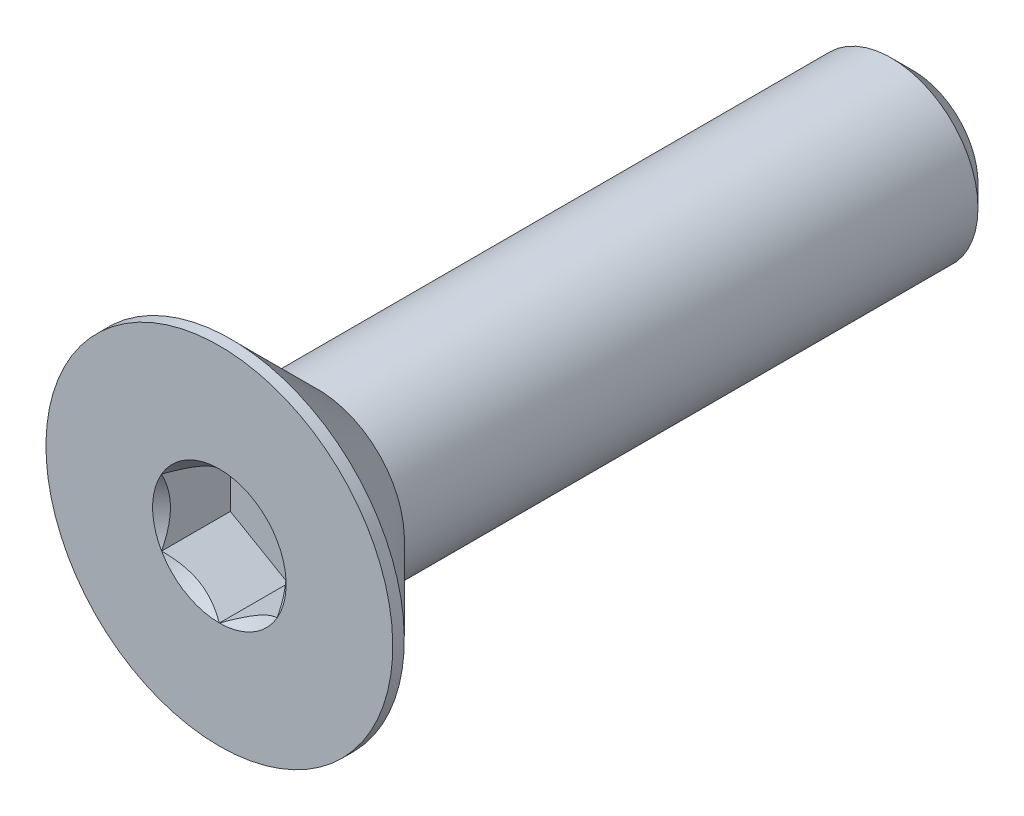
ISO-10303-21;
HEADER;
FILE_DESCRIPTION(('STEP AP214'),'2;1');
FILE_NAME('part.step','',(''),(''),'','','');
FILE_SCHEMA(('AUTOMOTIVE_DESIGN { 1 0 10303 214 1 1 1 1 }'));
ENDSEC;
DATA;
#1=APPLICATION_CONTEXT('core data for automotive mechanical design processes');
#2=APPLICATION_PROTOCOL_DEFINITION('international standard','automotive_design',2000,#1);
#3=PRODUCT_CONTEXT('',#1,'mechanical');
#4=PRODUCT('Part','Part','',(#3));
#5=PRODUCT_RELATED_PRODUCT_CATEGORY('part','',(#4));
#6=PRODUCT_DEFINITION_FORMATION('','',#4);
#7=PRODUCT_DEFINITION_CONTEXT('part definition',#1,'design');
#8=PRODUCT_DEFINITION('design','',#6,#7);
#9=PRODUCT_DEFINITION_SHAPE('','',#8);
#10=(LENGTH_UNIT() NAMED_UNIT(*) SI_UNIT(.MILLI.,.METRE.));
#11=(NAMED_UNIT(*) PLANE_ANGLE_UNIT() SI_UNIT($,.RADIAN.));
#12=(NAMED_UNIT(*) SI_UNIT($,.STERADIAN.) SOLID_ANGLE_UNIT());
#13=UNCERTAINTY_MEASURE_WITH_UNIT(LENGTH_MEASURE(1.E-05),#10,'distance_accuracy_value','');
#14=(GEOMETRIC_REPRESENTATION_CONTEXT(3) GLOBAL_UNCERTAINTY_ASSIGNED_CONTEXT((#13)) GLOBAL_UNIT_ASSIGNED_CONTEXT((#10,
#11,#12)) REPRESENTATION_CONTEXT('',''));
#15=CARTESIAN_POINT('',(0.,0.,0.));
#16=DIRECTION('',(0.,0.,1.));
#17=DIRECTION('',(1.,0.,0.));
#18=AXIS2_PLACEMENT_3D('',#15,#16,#17);
#19=CARTESIAN_POINT('',(1.,-0.577350269189626,-1.19));
#20=DIRECTION('',(0.,0.,1.));
#21=DIRECTION('',(1.,0.,0.));
#22=AXIS2_PLACEMENT_3D('',#19,#20,#21);
#23=PLANE('',#22);
#24=DIRECTION('',(0.,1.,0.));
#25=VECTOR('',#24,1.);
#26=CARTESIAN_POINT('',(-1.,0.577350269189626,-1.19));
#27=LINE('',#26,#25);
#28=CARTESIAN_POINT('',(-0.999999999999999,0.577350269189625,-1.19));
#29=VERTEX_POINT('',#28);
#30=CARTESIAN_POINT('',(-1.,-0.577350269189626,-1.19));
#31=VERTEX_POINT('',#30);
#32=EDGE_CURVE('E83',#29,#31,#27,.F.);
#33=ORIENTED_EDGE('',*,*,#32,.T.);
#34=DIRECTION('',(0.866025403784439,-0.5,0.));
#35=VECTOR('',#34,1.);
#36=CARTESIAN_POINT('',(-1.,-0.577350269189626,-1.19));
#37=LINE('',#36,#35);
#38=CARTESIAN_POINT('',(0.,-1.15470053837925,-1.19));
#39=VERTEX_POINT('',#38);
#40=EDGE_CURVE('E85',#31,#39,#37,.T.);
#41=ORIENTED_EDGE('',*,*,#40,.T.);
#42=DIRECTION('',(0.866025403784439,0.5,0.));
#43=VECTOR('',#42,1.);
#44=CARTESIAN_POINT('',(0.,-1.15470053837925,-1.19));
#45=LINE('',#44,#43);
#46=CARTESIAN_POINT('',(1.,-0.577350269189626,-1.19));
#47=VERTEX_POINT('',#46);
#48=EDGE_CURVE('E86',#39,#47,#45,.T.);
#49=ORIENTED_EDGE('',*,*,#48,.T.);
#50=DIRECTION('',(0.,1.,0.));
#51=VECTOR('',#50,1.);
#52=CARTESIAN_POINT('',(1.,-0.577350269189626,-1.19));
#53=LINE('',#52,#51);
#54=CARTESIAN_POINT('',(1.,0.577350269189626,-1.19));
#55=VERTEX_POINT('',#54);
#56=EDGE_CURVE('E72',#47,#55,#53,.T.);
#57=ORIENTED_EDGE('',*,*,#56,.T.);
#58=DIRECTION('',(-0.866025403784439,0.5,0.));
#59=VECTOR('',#58,1.);
#60=CARTESIAN_POINT('',(1.,0.577350269189626,-1.19));
#61=LINE('',#60,#59);
#62=CARTESIAN_POINT('',(0.,1.15470053837925,-1.19));
#63=VERTEX_POINT('',#62);
#64=EDGE_CURVE('E111',#55,#63,#61,.T.);
#65=ORIENTED_EDGE('',*,*,#64,.T.);
#66=DIRECTION('',(-0.866025403784439,-0.5,0.));
#67=VECTOR('',#66,1.);
#68=CARTESIAN_POINT('',(0.,1.15470053837925,-1.19));
#69=LINE('',#68,#67);
#70=EDGE_CURVE('E116',#63,#29,#69,.T.);
#71=ORIENTED_EDGE('',*,*,#70,.T.);
#72=EDGE_LOOP('',(#33,#41,#49,#57,#65,#71));
#73=FACE_BOUND('',#72,.T.);
#74=ADVANCED_FACE('F17',(#73),#23,.T.);
#75=CARTESIAN_POINT('',(0.,-1.15470053837925,-1.19));
#76=DIRECTION('',(0.5,-0.866025403784439,0.));
#77=DIRECTION('',(0.866025403784439,0.5,0.));
#78=AXIS2_PLACEMENT_3D('',#75,#76,#77);
#79=PLANE('',#78);
#80=CARTESIAN_POINT('',(-3.93149054121521E-11,-1.15470053837926,-9.98108843585172E-11));
#81=CARTESIAN_POINT('',(0.0343705355201057,-1.13485670043636,-0.0198247004221409));
#82=CARTESIAN_POINT('',(0.0693156756519455,-1.11468111438035,-0.0384849664872145));
#83=CARTESIAN_POINT('',(0.140572403035621,-1.07354102364821,-0.0726511232407905));
#84=CARTESIAN_POINT('',(0.176890763106012,-1.05257260868342,-0.0881380101422933));
#85=CARTESIAN_POINT('',(0.250125097696328,-1.01029074589262,-0.11466695978462));
#86=CARTESIAN_POINT('',(0.287022429458597,-0.988988061467716,-0.125775687570534));
#87=CARTESIAN_POINT('',(0.361628600499482,-0.945914168534358,-0.142891513233382));
#88=CARTESIAN_POINT('',(0.399335163701569,-0.924144274119301,-0.148911380305544));
#89=CARTESIAN_POINT('',(0.464327716043936,-0.886620806529054,-0.154341115390247));
#90=CARTESIAN_POINT('',(0.491529304810035,-0.87091596193258,-0.155143433217331));
#91=CARTESIAN_POINT('',(0.545879708710831,-0.839536741609904,-0.153791220399352));
#92=CARTESIAN_POINT('',(0.573028510861523,-0.823862373380022,-0.151636036594819));
#93=CARTESIAN_POINT('',(0.654087027893978,-0.777063216751215,-0.140876680449877));
#94=CARTESIAN_POINT('',(0.707593237347495,-0.746171392319914,-0.127977491939688));
#95=CARTESIAN_POINT('',(0.801462739355952,-0.691975810066637,-0.0968623195341796));
#96=CARTESIAN_POINT('',(0.842267871071583,-0.668416956286299,-0.0802830124023648));
#97=CARTESIAN_POINT('',(0.922281198810023,-0.622221239977752,-0.0429387151524039));
#98=CARTESIAN_POINT('',(0.961494106307927,-0.599581657278129,-0.0221873504710733));
#99=CARTESIAN_POINT('',(1.00000000003183,-0.577350269171246,-1.09229319045489E-10));
#100=B_SPLINE_CURVE_WITH_KNOTS('',3,(#80,#81,#82,#83,#84,#85,#86,#87,#88,#89,#90,#91,#92,#93,
#94,#95,#96,#97,#98,#99),.UNSPECIFIED.,.F.,.F.,(4,2,2,2,2,2,2,2,2,4),(0.,0.133182946587487,
0.267141541479663,0.398973326833972,0.530473323727982,0.624596460473079,0.718740387507005,
0.907081600610891,1.05673041335255,1.20589820631879),.UNSPECIFIED.);
#101=CARTESIAN_POINT('',(0.,-1.15470053839843,-1.08428125919993E-10));
#102=VERTEX_POINT('',#101);
#103=CARTESIAN_POINT('',(1.00000000001661,-0.577350269199215,-1.08427886418802E-10));
#104=VERTEX_POINT('',#103);
#105=EDGE_CURVE('E20',#102,#104,#100,.T.);
#106=ORIENTED_EDGE('',*,*,#105,.T.);
#107=DIRECTION('',(0.,0.,-1.));
#108=VECTOR('',#107,1.);
#109=CARTESIAN_POINT('',(1.,-0.577350269189626,-1.19));
#110=LINE('',#109,#108);
#111=EDGE_CURVE('E91',#104,#47,#110,.T.);
#112=ORIENTED_EDGE('',*,*,#111,.T.);
#113=ORIENTED_EDGE('',*,*,#48,.F.);
#114=DIRECTION('',(0.,0.,1.));
#115=VECTOR('',#114,1.);
#116=CARTESIAN_POINT('',(0.,-1.15470053837925,-1.19));
#117=LINE('',#116,#115);
#118=EDGE_CURVE('E59',#39,#102,#117,.T.);
#119=ORIENTED_EDGE('',*,*,#118,.T.);
#120=EDGE_LOOP('',(#106,#112,#113,#119));
#121=FACE_BOUND('',#120,.T.);
#122=ADVANCED_FACE('F90',(#121),#79,.F.);
#123=CARTESIAN_POINT('',(-1.,-0.577350269189626,-1.19));
#124=DIRECTION('',(-0.5,-0.866025403784439,0.));
#125=DIRECTION('',(0.866025403784439,-0.5,0.));
#126=AXIS2_PLACEMENT_3D('',#123,#124,#125);
#127=PLANE('',#126);
#128=CARTESIAN_POINT('',(-1.00000000001966,-0.577350269155583,-9.98096310247959E-11));
#129=CARTESIAN_POINT('',(-0.965629464472823,-0.597194107120269,-0.0198247004221396));
#130=CARTESIAN_POINT('',(-0.930684324346155,-0.617369693185242,-0.0384849664872131));
#131=CARTESIAN_POINT('',(-0.859427596966287,-0.658509783923978,-0.0726511232407891));
#132=CARTESIAN_POINT('',(-0.823109236894494,-0.679478198886334,-0.0881380101422919));
#133=CARTESIAN_POINT('',(-0.749874902303172,-0.721760061675394,-0.114666959784619));
#134=CARTESIAN_POINT('',(-0.71297757054127,-0.743062746100931,-0.125775687570532));
#135=CARTESIAN_POINT('',(-0.638371399500649,-0.786136639034746,-0.14289151323338));
#136=CARTESIAN_POINT('',(-0.600664836298461,-0.807906533449627,-0.148911380305542));
#137=CARTESIAN_POINT('',(-0.535672283956042,-0.845430001039785,-0.154341115390246));
#138=CARTESIAN_POINT('',(-0.508470695189959,-0.861134845636286,-0.155143433217329));
#139=CARTESIAN_POINT('',(-0.454120291289175,-0.892514065958982,-0.15379122039935));
#140=CARTESIAN_POINT('',(-0.426971489138479,-0.908188434188858,-0.151636036594817));
#141=CARTESIAN_POINT('',(-0.345912972106017,-0.954987590817655,-0.140876680449876));
#142=CARTESIAN_POINT('',(-0.292406762652503,-0.985879415248961,-0.127977491939686));
#143=CARTESIAN_POINT('',(-0.198537260644048,-1.04007499750224,-0.0968623195341786));
#144=CARTESIAN_POINT('',(-0.157732128928417,-1.06363385128258,-0.0802830124023638));
#145=CARTESIAN_POINT('',(-0.0777188011899764,-1.10982956759112,-0.0429387151524029));
#146=CARTESIAN_POINT('',(-0.0385058936920724,-1.13246915029075,-0.0221873504710723));
#147=CARTESIAN_POINT('',(3.18328951443562E-11,-1.15470053839763,-1.09228385770901E-10));
#148=B_SPLINE_CURVE_WITH_KNOTS('',3,(#128,#129,#130,#131,#132,#133,#134,#135,#136,#137,#138,
#139,#140,#141,#142,#143,#144,#145,#146,#147),.UNSPECIFIED.,.F.,.F.,(4,2,2,2,2,2,2,2,2,4),(0.,
0.133182946587487,0.267141541479662,0.398973326833972,0.530473323727981,0.624596460473079,
0.718740387507004,0.907081600610891,1.05673041335255,1.20589820631879),.UNSPECIFIED.);
#149=CARTESIAN_POINT('',(-1.00000000001661,-0.577350269199216,-1.0842737744144E-10));
#150=VERTEX_POINT('',#149);
#151=EDGE_CURVE('E95',#150,#102,#148,.T.);
#152=ORIENTED_EDGE('',*,*,#151,.T.);
#153=ORIENTED_EDGE('',*,*,#118,.F.);
#154=ORIENTED_EDGE('',*,*,#40,.F.);
#155=DIRECTION('',(0.,0.,1.));
#156=VECTOR('',#155,1.);
#157=CARTESIAN_POINT('',(-1.,-0.577350269189626,-1.19));
#158=LINE('',#157,#156);
#159=EDGE_CURVE('E97',#31,#150,#158,.T.);
#160=ORIENTED_EDGE('',*,*,#159,.T.);
#161=EDGE_LOOP('',(#152,#153,#154,#160));
#162=FACE_BOUND('',#161,.T.);
#163=ADVANCED_FACE('F93',(#162),#127,.F.);
#164=CARTESIAN_POINT('',(-1.,0.577350269189626,-1.19));
#165=DIRECTION('',(-1.,0.,0.));
#166=DIRECTION('',(0.,0.,1.));
#167=AXIS2_PLACEMENT_3D('',#164,#165,#166);
#168=PLANE('',#167);
#169=CARTESIAN_POINT('',(-0.999999999980349,0.577350269223676,-9.98097333743558E-11));
#170=CARTESIAN_POINT('',(-0.999999999992929,0.537662593316093,-0.0198247004221396));
#171=CARTESIAN_POINT('',(-0.999999999998101,0.497311421195105,-0.0384849664872131));
#172=CARTESIAN_POINT('',(-1.00000000000191,0.41503123972423,-0.0726511232407892));
#173=CARTESIAN_POINT('',(-1.00000000000051,0.373094409797089,-0.0881380101422921));
#174=CARTESIAN_POINT('',(-0.999999999999501,0.288530684217224,-0.114666959784619));
#175=CARTESIAN_POINT('',(-0.999999999999868,0.245925315366786,-0.125775687570532));
#176=CARTESIAN_POINT('',(-1.00000000000013,0.159777529499614,-0.142891513233381));
#177=CARTESIAN_POINT('',(-1.00000000000003,0.116237740669674,-0.148911380305542));
#178=CARTESIAN_POINT('',(-0.999999999999979,0.0411908054892712,-0.154341115390246));
#179=CARTESIAN_POINT('',(-0.999999999999994,0.00978111629629506,-0.155143433217329));
#180=CARTESIAN_POINT('',(-1.00000000000001,-0.0529773243490767,-0.15379122039935));
#181=CARTESIAN_POINT('',(-1.,-0.0843260608088347,-0.151636036594817));
#182=CARTESIAN_POINT('',(-0.999999999999996,-0.177924374066439,-0.140876680449876));
#183=CARTESIAN_POINT('',(-0.999999999999999,-0.239708022929046,-0.127977491939686));
#184=CARTESIAN_POINT('',(-1.,-0.348099187435602,-0.0968623195341786));
#185=CARTESIAN_POINT('',(-1.,-0.395216894996278,-0.0802830124023637));
#186=CARTESIAN_POINT('',(-1.,-0.48760832761337,-0.0429387151524027));
#187=CARTESIAN_POINT('',(-0.999999999999999,-0.532887493012616,-0.0221873504710721));
#188=CARTESIAN_POINT('',(-1.,-0.577350269226384,-1.09228152961273E-10));
#189=B_SPLINE_CURVE_WITH_KNOTS('',3,(#169,#170,#171,#172,#173,#174,#175,#176,#177,#178,#179,
#180,#181,#182,#183,#184,#185,#186,#187,#188),.UNSPECIFIED.,.F.,.F.,(4,2,2,2,2,2,2,2,2,4),(0.,
0.133182946587487,0.267141541479662,0.398973326833972,0.530473323727981,0.624596460473079,
0.718740387507004,0.907081600610891,1.05673041335255,1.20589820631879),.UNSPECIFIED.);
#190=CARTESIAN_POINT('',(-1.00000000001661,0.577350269199215,-1.08428019609571E-10));
#191=VERTEX_POINT('',#190);
#192=EDGE_CURVE('E195',#191,#150,#189,.T.);
#193=ORIENTED_EDGE('',*,*,#192,.T.);
#194=ORIENTED_EDGE('',*,*,#159,.F.);
#195=ORIENTED_EDGE('',*,*,#32,.F.);
#196=DIRECTION('',(0.,0.,1.));
#197=VECTOR('',#196,1.);
#198=CARTESIAN_POINT('',(-0.999999999999999,0.577350269189625,-1.19));
#199=LINE('',#198,#197);
#200=EDGE_CURVE('E113',#29,#191,#199,.T.);
#201=ORIENTED_EDGE('',*,*,#200,.T.);
#202=EDGE_LOOP('',(#193,#194,#195,#201));
#203=FACE_BOUND('',#202,.T.);
#204=ADVANCED_FACE('F205',(#203),#168,.F.);
#205=CARTESIAN_POINT('',(0.,1.15470053837925,-1.19));
#206=DIRECTION('',(-0.5,0.866025403784439,0.));
#207=DIRECTION('',(-0.866025403784439,-0.5,0.));
#208=AXIS2_PLACEMENT_3D('',#205,#206,#207);
#209=PLANE('',#208);
#210=CARTESIAN_POINT('',(3.93151646223952E-11,1.15470053837926,-9.98107705230224E-11));
#211=CARTESIAN_POINT('',(-0.0343705355201054,1.13485670043636,-0.0198247004221408));
#212=CARTESIAN_POINT('',(-0.0693156756519452,1.11468111438035,-0.0384849664872144));
#213=CARTESIAN_POINT('',(-0.140572403035621,1.07354102364821,-0.0726511232407903));
#214=CARTESIAN_POINT('',(-0.176890763106012,1.05257260868342,-0.0881380101422932));
#215=CARTESIAN_POINT('',(-0.250125097696327,1.01029074589262,-0.11466695978462));
#216=CARTESIAN_POINT('',(-0.287022429458596,0.988988061467716,-0.125775687570534));
#217=CARTESIAN_POINT('',(-0.361628600499482,0.945914168534359,-0.142891513233382));
#218=CARTESIAN_POINT('',(-0.399335163701568,0.924144274119301,-0.148911380305544));
#219=CARTESIAN_POINT('',(-0.464327716043936,0.886620806529055,-0.154341115390247));
#220=CARTESIAN_POINT('',(-0.491529304810035,0.87091596193258,-0.155143433217331));
#221=CARTESIAN_POINT('',(-0.54587970871083,0.839536741609904,-0.153791220399352));
#222=CARTESIAN_POINT('',(-0.573028510861522,0.823862373380022,-0.151636036594819));
#223=CARTESIAN_POINT('',(-0.654087027893978,0.777063216751215,-0.140876680449878));
#224=CARTESIAN_POINT('',(-0.707593237347495,0.746171392319914,-0.127977491939688));
#225=CARTESIAN_POINT('',(-0.801462739355952,0.691975810066637,-0.09686231953418));
#226=CARTESIAN_POINT('',(-0.842267871071583,0.668416956286299,-0.0802830124023651));
#227=CARTESIAN_POINT('',(-0.922281198810023,0.622221239977752,-0.0429387151524039));
#228=CARTESIAN_POINT('',(-0.961494106307927,0.599581657278129,-0.0221873504710733));
#229=CARTESIAN_POINT('',(-1.00000000003183,0.577350269171245,-1.09229131326547E-10));
#230=B_SPLINE_CURVE_WITH_KNOTS('',3,(#210,#211,#212,#213,#214,#215,#216,#217,#218,#219,#220,
#221,#222,#223,#224,#225,#226,#227,#228,#229),.UNSPECIFIED.,.F.,.F.,(4,2,2,2,2,2,2,2,2,4),(0.,
0.133182946587487,0.267141541479663,0.398973326833972,0.530473323727982,0.624596460473079,
0.718740387507005,0.907081600610891,1.05673041335255,1.20589820631879),.UNSPECIFIED.);
#231=CARTESIAN_POINT('',(0.,1.15470053839843,-1.08428125033619E-10));
#232=VERTEX_POINT('',#231);
#233=EDGE_CURVE('E187',#232,#191,#230,.T.);
#234=ORIENTED_EDGE('',*,*,#233,.T.);
#235=ORIENTED_EDGE('',*,*,#200,.F.);
#236=ORIENTED_EDGE('',*,*,#70,.F.);
#237=DIRECTION('',(0.,0.,1.));
#238=VECTOR('',#237,1.);
#239=CARTESIAN_POINT('',(0.,1.15470053837925,-1.19));
#240=LINE('',#239,#238);
#241=EDGE_CURVE('E108',#63,#232,#240,.T.);
#242=ORIENTED_EDGE('',*,*,#241,.T.);
#243=EDGE_LOOP('',(#234,#235,#236,#242));
#244=FACE_BOUND('',#243,.T.);
#245=ADVANCED_FACE('F201',(#244),#209,.F.);
#246=CARTESIAN_POINT('',(1.,0.577350269189626,-1.19));
#247=DIRECTION('',(0.5,0.866025403784439,0.));
#248=DIRECTION('',(-0.866025403784439,0.5,0.));
#249=AXIS2_PLACEMENT_3D('',#246,#247,#248);
#250=PLANE('',#249);
#251=CARTESIAN_POINT('',(1.00000000001966,0.577350269155583,-9.98095491029833E-11));
#252=CARTESIAN_POINT('',(0.965629464472823,0.597194107120269,-0.0198247004221397));
#253=CARTESIAN_POINT('',(0.930684324346155,0.617369693185242,-0.0384849664872132));
#254=CARTESIAN_POINT('',(0.859427596966287,0.658509783923978,-0.0726511232407891));
#255=CARTESIAN_POINT('',(0.823109236894494,0.679478198886334,-0.0881380101422918));
#256=CARTESIAN_POINT('',(0.749874902303172,0.721760061675394,-0.114666959784619));
#257=CARTESIAN_POINT('',(0.712977570541271,0.743062746100931,-0.125775687570532));
#258=CARTESIAN_POINT('',(0.638371399500649,0.786136639034746,-0.142891513233381));
#259=CARTESIAN_POINT('',(0.600664836298461,0.807906533449627,-0.148911380305542));
#260=CARTESIAN_POINT('',(0.535672283956042,0.845430001039784,-0.154341115390246));
#261=CARTESIAN_POINT('',(0.508470695189959,0.861134845636286,-0.155143433217329));
#262=CARTESIAN_POINT('',(0.454120291289175,0.892514065958982,-0.15379122039935));
#263=CARTESIAN_POINT('',(0.426971489138479,0.908188434188858,-0.151636036594817));
#264=CARTESIAN_POINT('',(0.345912972106017,0.954987590817654,-0.140876680449876));
#265=CARTESIAN_POINT('',(0.292406762652503,0.985879415248961,-0.127977491939686));
#266=CARTESIAN_POINT('',(0.198537260644048,1.04007499750224,-0.0968623195341785));
#267=CARTESIAN_POINT('',(0.157732128928417,1.06363385128258,-0.0802830124023638));
#268=CARTESIAN_POINT('',(0.0777188011899766,1.10982956759112,-0.042938715152403));
#269=CARTESIAN_POINT('',(0.0385058936920726,1.13246915029075,-0.0221873504710725));
#270=CARTESIAN_POINT('',(-3.18326351011692E-11,1.15470053839763,-1.0922858632033E-10));
#271=B_SPLINE_CURVE_WITH_KNOTS('',3,(#251,#252,#253,#254,#255,#256,#257,#258,#259,#260,#261,
#262,#263,#264,#265,#266,#267,#268,#269,#270),.UNSPECIFIED.,.F.,.F.,(4,2,2,2,2,2,2,2,2,4),(0.,
0.133182946587487,0.267141541479662,0.398973326833972,0.530473323727981,0.624596460473079,
0.718740387507004,0.907081600610891,1.05673041335255,1.20589820631879),.UNSPECIFIED.);
#272=CARTESIAN_POINT('',(1.00000000001661,0.577350269199216,-1.08427368694382E-10));
#273=VERTEX_POINT('',#272);
#274=EDGE_CURVE('E157',#273,#232,#271,.T.);
#275=ORIENTED_EDGE('',*,*,#274,.T.);
#276=ORIENTED_EDGE('',*,*,#241,.F.);
#277=ORIENTED_EDGE('',*,*,#64,.F.);
#278=DIRECTION('',(0.,0.,-1.));
#279=VECTOR('',#278,1.);
#280=CARTESIAN_POINT('',(1.,0.577350269189626,-1.19));
#281=LINE('',#280,#279);
#282=EDGE_CURVE('E40',#55,#273,#281,.F.);
#283=ORIENTED_EDGE('',*,*,#282,.T.);
#284=EDGE_LOOP('',(#275,#276,#277,#283));
#285=FACE_BOUND('',#284,.T.);
#286=ADVANCED_FACE('F204',(#285),#250,.F.);
#287=CARTESIAN_POINT('',(1.,-0.577350269189626,-1.19));
#288=DIRECTION('',(1.,0.,0.));
#289=DIRECTION('',(0.,0.,-1.));
#290=AXIS2_PLACEMENT_3D('',#287,#288,#289);
#291=PLANE('',#290);
#292=CARTESIAN_POINT('',(0.999999999980349,-0.577350269223676,-9.98095983586252E-11));
#293=CARTESIAN_POINT('',(0.999999999992929,-0.537662593316093,-0.0198247004221395));
#294=CARTESIAN_POINT('',(0.999999999998101,-0.497311421195106,-0.0384849664872131));
#295=CARTESIAN_POINT('',(1.00000000000191,-0.41503123972423,-0.0726511232407892));
#296=CARTESIAN_POINT('',(1.00000000000051,-0.373094409797089,-0.0881380101422921));
#297=CARTESIAN_POINT('',(0.999999999999501,-0.288530684217224,-0.114666959784619));
#298=CARTESIAN_POINT('',(0.999999999999868,-0.245925315366786,-0.125775687570532));
#299=CARTESIAN_POINT('',(1.00000000000013,-0.159777529499614,-0.142891513233381));
#300=CARTESIAN_POINT('',(1.00000000000003,-0.116237740669674,-0.148911380305542));
#301=CARTESIAN_POINT('',(0.999999999999979,-0.0411908054892709,-0.154341115390246));
#302=CARTESIAN_POINT('',(0.999999999999994,-0.00978111629629477,-0.155143433217329));
#303=CARTESIAN_POINT('',(1.00000000000001,0.052977324349077,-0.15379122039935));
#304=CARTESIAN_POINT('',(1.,0.084326060808835,-0.151636036594817));
#305=CARTESIAN_POINT('',(0.999999999999996,0.177924374066439,-0.140876680449876));
#306=CARTESIAN_POINT('',(0.999999999999999,0.239708022929047,-0.127977491939686));
#307=CARTESIAN_POINT('',(1.,0.348099187435603,-0.0968623195341784));
#308=CARTESIAN_POINT('',(1.,0.395216894996278,-0.0802830124023636));
#309=CARTESIAN_POINT('',(1.,0.48760832761337,-0.0429387151524028));
#310=CARTESIAN_POINT('',(0.999999999999999,0.532887493012616,-0.0221873504710722));
#311=CARTESIAN_POINT('',(1.,0.577350269226384,-1.09228152479802E-10));
#312=B_SPLINE_CURVE_WITH_KNOTS('',3,(#292,#293,#294,#295,#296,#297,#298,#299,#300,#301,#302,
#303,#304,#305,#306,#307,#308,#309,#310,#311),.UNSPECIFIED.,.F.,.F.,(4,2,2,2,2,2,2,2,2,4),(0.,
0.133182946587487,0.267141541479663,0.398973326833972,0.530473323727982,0.624596460473079,
0.718740387507005,0.907081600610892,1.05673041335255,1.20589820631879),.UNSPECIFIED.);
#313=EDGE_CURVE('E149',#104,#273,#312,.T.);
#314=ORIENTED_EDGE('',*,*,#313,.T.);
#315=ORIENTED_EDGE('',*,*,#282,.F.);
#316=ORIENTED_EDGE('',*,*,#56,.F.);
#317=ORIENTED_EDGE('',*,*,#111,.F.);
#318=EDGE_LOOP('',(#314,#315,#316,#317));
#319=FACE_BOUND('',#318,.T.);
#320=ADVANCED_FACE('F165',(#319),#291,.F.);
#321=CARTESIAN_POINT('',(0.,0.,-1.70530256582424E-10));
#322=DIRECTION('',(0.,0.,1.));
#323=DIRECTION('',(1.,0.,0.));
#324=AXIS2_PLACEMENT_3D('',#321,#322,#323);
#325=CONICAL_SURFACE('',#324,1.15470053833633,0.785398163397448);
#326=ORIENTED_EDGE('',*,*,#105,.F.);
#327=CARTESIAN_POINT('',(0.,0.,-1.13686837721616E-10));
#328=DIRECTION('',(0.,0.,1.));
#329=DIRECTION('',(1.,0.,0.));
#330=AXIS2_PLACEMENT_3D('',#327,#328,#329);
#331=CIRCLE('',#330,1.15470053839317);
#332=EDGE_CURVE('E146',#104,#102,#331,.F.);
#333=ORIENTED_EDGE('',*,*,#332,.F.);
#334=EDGE_LOOP('',(#326,#333));
#335=FACE_BOUND('',#334,.T.);
#336=ADVANCED_FACE('F222',(#335),#325,.F.);
#337=CARTESIAN_POINT('',(0.,0.,-1.70530256582424E-10));
#338=DIRECTION('',(0.,0.,1.));
#339=DIRECTION('',(1.,0.,0.));
#340=AXIS2_PLACEMENT_3D('',#337,#338,#339);
#341=CONICAL_SURFACE('',#340,1.15470053833633,0.785398163397448);
#342=ORIENTED_EDGE('',*,*,#151,.F.);
#343=CARTESIAN_POINT('',(0.,0.,-1.13686837721616E-10));
#344=DIRECTION('',(0.,0.,1.));
#345=DIRECTION('',(1.,0.,0.));
#346=AXIS2_PLACEMENT_3D('',#343,#344,#345);
#347=CIRCLE('',#346,1.15470053839317);
#348=EDGE_CURVE('E143',#102,#150,#347,.F.);
#349=ORIENTED_EDGE('',*,*,#348,.F.);
#350=EDGE_LOOP('',(#342,#349));
#351=FACE_BOUND('',#350,.T.);
#352=ADVANCED_FACE('F219',(#351),#341,.F.);
#353=CARTESIAN_POINT('',(0.,0.,-1.70530256582424E-10));
#354=DIRECTION('',(0.,0.,1.));
#355=DIRECTION('',(1.,0.,0.));
#356=AXIS2_PLACEMENT_3D('',#353,#354,#355);
#357=CONICAL_SURFACE('',#356,1.15470053833633,0.785398163397448);
#358=ORIENTED_EDGE('',*,*,#192,.F.);
#359=CARTESIAN_POINT('',(0.,0.,-1.13686837721616E-10));
#360=DIRECTION('',(0.,0.,1.));
#361=DIRECTION('',(1.,0.,0.));
#362=AXIS2_PLACEMENT_3D('',#359,#360,#361);
#363=CIRCLE('',#362,1.15470053839317);
#364=EDGE_CURVE('E140',#150,#191,#363,.F.);
#365=ORIENTED_EDGE('',*,*,#364,.F.);
#366=EDGE_LOOP('',(#358,#365));
#367=FACE_BOUND('',#366,.T.);
#368=ADVANCED_FACE('F183',(#367),#357,.F.);
#369=CARTESIAN_POINT('',(0.,0.,-1.70530256582424E-10));
#370=DIRECTION('',(0.,0.,1.));
#371=DIRECTION('',(1.,0.,0.));
#372=AXIS2_PLACEMENT_3D('',#369,#370,#371);
#373=CONICAL_SURFACE('',#372,1.15470053833633,0.785398163397448);
#374=ORIENTED_EDGE('',*,*,#233,.F.);
#375=CARTESIAN_POINT('',(0.,0.,-1.13686837721616E-10));
#376=DIRECTION('',(0.,0.,1.));
#377=DIRECTION('',(1.,0.,0.));
#378=AXIS2_PLACEMENT_3D('',#375,#376,#377);
#379=CIRCLE('',#378,1.15470053839317);
#380=EDGE_CURVE('E137',#191,#232,#379,.F.);
#381=ORIENTED_EDGE('',*,*,#380,.F.);
#382=EDGE_LOOP('',(#374,#381));
#383=FACE_BOUND('',#382,.T.);
#384=ADVANCED_FACE('F178',(#383),#373,.F.);
#385=CARTESIAN_POINT('',(0.,0.,-1.70530256582424E-10));
#386=DIRECTION('',(0.,0.,1.));
#387=DIRECTION('',(1.,0.,0.));
#388=AXIS2_PLACEMENT_3D('',#385,#386,#387);
#389=CONICAL_SURFACE('',#388,1.15470053833633,0.785398163397448);
#390=ORIENTED_EDGE('',*,*,#274,.F.);
#391=CARTESIAN_POINT('',(0.,0.,-1.13686837721616E-10));
#392=DIRECTION('',(0.,0.,1.));
#393=DIRECTION('',(1.,0.,0.));
#394=AXIS2_PLACEMENT_3D('',#391,#392,#393);
#395=CIRCLE('',#394,1.15470053839317);
#396=EDGE_CURVE('E134',#232,#273,#395,.F.);
#397=ORIENTED_EDGE('',*,*,#396,.F.);
#398=EDGE_LOOP('',(#390,#397));
#399=FACE_BOUND('',#398,.T.);
#400=ADVANCED_FACE('F172',(#399),#389,.F.);
#401=CARTESIAN_POINT('',(0.,0.,-1.70530256582424E-10));
#402=DIRECTION('',(0.,0.,1.));
#403=DIRECTION('',(1.,0.,0.));
#404=AXIS2_PLACEMENT_3D('',#401,#402,#403);
#405=CONICAL_SURFACE('',#404,1.15470053833633,0.785398163397448);
#406=CARTESIAN_POINT('',(0.,0.,-1.13686837721616E-10));
#407=DIRECTION('',(0.,0.,1.));
#408=DIRECTION('',(1.,0.,0.));
#409=AXIS2_PLACEMENT_3D('',#406,#407,#408);
#410=CIRCLE('',#409,1.15470053839317);
#411=EDGE_CURVE('E131',#273,#104,#410,.F.);
#412=ORIENTED_EDGE('',*,*,#411,.F.);
#413=ORIENTED_EDGE('',*,*,#313,.F.);
#414=EDGE_LOOP('',(#412,#413));
#415=FACE_BOUND('',#414,.T.);
#416=ADVANCED_FACE('F167',(#415),#405,.F.);
#417=CARTESIAN_POINT('',(0.,-1.5,0.));
#418=DIRECTION('',(0.,0.,1.));
#419=DIRECTION('',(0.,-1.,0.));
#420=AXIS2_PLACEMENT_3D('',#417,#418,#419);
#421=PLANE('',#420);
#422=ORIENTED_EDGE('',*,*,#396,.T.);
#423=ORIENTED_EDGE('',*,*,#411,.T.);
#424=ORIENTED_EDGE('',*,*,#332,.T.);
#425=ORIENTED_EDGE('',*,*,#348,.T.);
#426=ORIENTED_EDGE('',*,*,#364,.T.);
#427=ORIENTED_EDGE('',*,*,#380,.T.);
#428=EDGE_LOOP('',(#422,#423,#424,#425,#426,#427));
#429=FACE_BOUND('',#428,.T.);
#430=CARTESIAN_POINT('',(0.,0.,0.));
#431=DIRECTION('',(0.,0.,1.));
#432=DIRECTION('',(0.,-1.,0.));
#433=AXIS2_PLACEMENT_3D('',#430,#431,#432);
#434=CIRCLE('',#433,3.);
#435=CARTESIAN_POINT('',(0.,-3.,0.));
#436=VERTEX_POINT('',#435);
#437=EDGE_CURVE('E128',#436,#436,#434,.F.);
#438=ORIENTED_EDGE('',*,*,#437,.F.);
#439=EDGE_LOOP('',(#438));
#440=FACE_BOUND('',#439,.T.);
#441=ADVANCED_FACE('F171',(#429,#440),#421,.T.);
#442=CARTESIAN_POINT('',(0.,0.,0.));
#443=DIRECTION('',(0.,0.,1.));
#444=DIRECTION('',(0.,-1.,0.));
#445=AXIS2_PLACEMENT_3D('',#442,#443,#444);
#446=CYLINDRICAL_SURFACE('',#445,3.);
#447=CARTESIAN_POINT('',(0.,0.,-0.200000000006641));
#448=DIRECTION('',(0.,0.,1.));
#449=DIRECTION('',(0.,-1.,0.));
#450=AXIS2_PLACEMENT_3D('',#447,#448,#449);
#451=CIRCLE('',#450,3.00000000004275);
#452=CARTESIAN_POINT('',(0.,-3.00000000004275,-0.200000000006639));
#453=VERTEX_POINT('',#452);
#454=EDGE_CURVE('E127',#453,#453,#451,.F.);
#455=ORIENTED_EDGE('',*,*,#454,.F.);
#456=EDGE_LOOP('',(#455));
#457=FACE_BOUND('',#456,.T.);
#458=ORIENTED_EDGE('',*,*,#437,.T.);
#459=EDGE_LOOP('',(#458));
#460=FACE_BOUND('',#459,.T.);
#461=ADVANCED_FACE('F250',(#457,#460),#446,.T.);
#462=CARTESIAN_POINT('',(0.,-1.5,-12.));
#463=DIRECTION('',(0.,0.,-1.));
#464=DIRECTION('',(0.,1.,0.));
#465=AXIS2_PLACEMENT_3D('',#462,#463,#464);
#466=PLANE('',#465);
#467=CARTESIAN_POINT('',(0.,0.,-12.0000000000005));
#468=DIRECTION('',(0.,0.,1.));
#469=DIRECTION('',(1.,0.,0.));
#470=AXIS2_PLACEMENT_3D('',#467,#468,#469);
#471=CIRCLE('',#470,1.12500000000182);
#472=CARTESIAN_POINT('',(1.12500000000182,0.,-12.0000000000005));
#473=VERTEX_POINT('',#472);
#474=EDGE_CURVE('E124',#473,#473,#471,.T.);
#475=ORIENTED_EDGE('',*,*,#474,.F.);
#476=EDGE_LOOP('',(#475));
#477=FACE_BOUND('',#476,.T.);
#478=ADVANCED_FACE('F247',(#477),#466,.T.);
#479=CARTESIAN_POINT('',(0.,0.,-0.200000000177172));
#480=DIRECTION('',(0.,0.,1.));
#481=DIRECTION('',(0.,-1.,0.));
#482=AXIS2_PLACEMENT_3D('',#479,#480,#481);
#483=CONICAL_SURFACE('',#482,2.99999999987222,0.785398163397449);
#484=CARTESIAN_POINT('',(0.,0.,-1.7));
#485=DIRECTION('',(0.,0.,1.));
#486=DIRECTION('',(0.,-1.,0.));
#487=AXIS2_PLACEMENT_3D('',#484,#485,#486);
#488=CIRCLE('',#487,1.5);
#489=CARTESIAN_POINT('',(0.,-1.50000000000001,-1.7));
#490=VERTEX_POINT('',#489);
#491=EDGE_CURVE('E31',#490,#490,#488,.F.);
#492=ORIENTED_EDGE('',*,*,#491,.F.);
#493=EDGE_LOOP('',(#492));
#494=FACE_BOUND('',#493,.T.);
#495=ORIENTED_EDGE('',*,*,#454,.T.);
#496=EDGE_LOOP('',(#495));
#497=FACE_BOUND('',#496,.T.);
#498=ADVANCED_FACE('F240',(#494,#497),#483,.T.);
#499=CARTESIAN_POINT('',(0.,0.,-11.6249999999809));
#500=DIRECTION('',(0.,0.,1.));
#501=DIRECTION('',(1.,0.,0.));
#502=AXIS2_PLACEMENT_3D('',#499,#500,#501);
#503=CONICAL_SURFACE('',#502,1.50000000002137,0.785398163397448);
#504=ORIENTED_EDGE('',*,*,#474,.T.);
#505=EDGE_LOOP('',(#504));
#506=FACE_BOUND('',#505,.T.);
#507=CARTESIAN_POINT('',(0.,0.,-11.625));
#508=DIRECTION('',(0.,0.,1.));
#509=DIRECTION('',(0.,-1.,0.));
#510=AXIS2_PLACEMENT_3D('',#507,#508,#509);
#511=CIRCLE('',#510,1.5);
#512=CARTESIAN_POINT('',(0.,-1.5,-11.625));
#513=VERTEX_POINT('',#512);
#514=EDGE_CURVE('E11',#513,#513,#511,.T.);
#515=ORIENTED_EDGE('',*,*,#514,.F.);
#516=EDGE_LOOP('',(#515));
#517=FACE_BOUND('',#516,.T.);
#518=ADVANCED_FACE('F234',(#506,#517),#503,.T.);
#519=CARTESIAN_POINT('',(0.,0.,-12.));
#520=DIRECTION('',(0.,0.,1.));
#521=DIRECTION('',(0.,-1.,0.));
#522=AXIS2_PLACEMENT_3D('',#519,#520,#521);
#523=CYLINDRICAL_SURFACE('',#522,1.5);
#524=ORIENTED_EDGE('',*,*,#514,.T.);
#525=EDGE_LOOP('',(#524));
#526=FACE_BOUND('',#525,.T.);
#527=ORIENTED_EDGE('',*,*,#491,.T.);
#528=EDGE_LOOP('',(#527));
#529=FACE_BOUND('',#528,.T.);
#530=ADVANCED_FACE('F232',(#526,#529),#523,.T.);
#531=CLOSED_SHELL('',(#74,#122,#163,#204,#245,#286,#320,#336,#352,#368,#384,#400,#416,#441,#461,
#478,#498,#518,#530));
#532=MANIFOLD_SOLID_BREP('B1',#531);
#533=ADVANCED_BREP_SHAPE_REPRESENTATION('',(#18,#532),#14);
#534=SHAPE_DEFINITION_REPRESENTATION(#9,#533);
ENDSEC;
END-ISO-10303-21;
